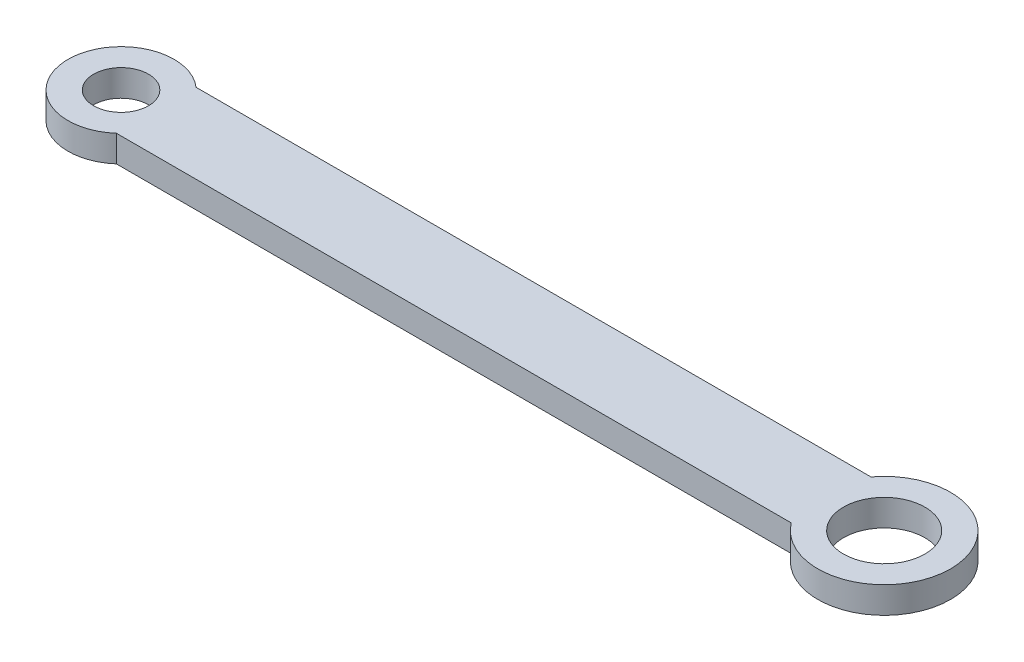
ISO-10303-21;
HEADER;
FILE_DESCRIPTION(('STEP AP214'),'2;1');
FILE_NAME('part.step','',(''),(''),'','','');
FILE_SCHEMA(('AUTOMOTIVE_DESIGN { 1 0 10303 214 1 1 1 1 }'));
ENDSEC;
DATA;
#1=APPLICATION_CONTEXT('core data for automotive mechanical design processes');
#2=APPLICATION_PROTOCOL_DEFINITION('international standard','automotive_design',2000,#1);
#3=PRODUCT_CONTEXT('',#1,'mechanical');
#4=PRODUCT('Part','Part','',(#3));
#5=PRODUCT_RELATED_PRODUCT_CATEGORY('part','',(#4));
#6=PRODUCT_DEFINITION_FORMATION('','',#4);
#7=PRODUCT_DEFINITION_CONTEXT('part definition',#1,'design');
#8=PRODUCT_DEFINITION('design','',#6,#7);
#9=PRODUCT_DEFINITION_SHAPE('','',#8);
#10=(LENGTH_UNIT() NAMED_UNIT(*) SI_UNIT(.MILLI.,.METRE.));
#11=(NAMED_UNIT(*) PLANE_ANGLE_UNIT() SI_UNIT($,.RADIAN.));
#12=(NAMED_UNIT(*) SI_UNIT($,.STERADIAN.) SOLID_ANGLE_UNIT());
#13=UNCERTAINTY_MEASURE_WITH_UNIT(LENGTH_MEASURE(1.E-05),#10,'distance_accuracy_value','');
#14=(GEOMETRIC_REPRESENTATION_CONTEXT(3) GLOBAL_UNCERTAINTY_ASSIGNED_CONTEXT((#13)) GLOBAL_UNIT_ASSIGNED_CONTEXT((#10,
#11,#12)) REPRESENTATION_CONTEXT('',''));
#15=CARTESIAN_POINT('',(0.,0.,0.));
#16=DIRECTION('',(0.,0.,1.));
#17=DIRECTION('',(1.,0.,0.));
#18=AXIS2_PLACEMENT_3D('',#15,#16,#17);
#19=CARTESIAN_POINT('',(0.,3.,0.));
#20=DIRECTION('',(0.,-1.,0.));
#21=DIRECTION('',(0.,0.,-1.));
#22=AXIS2_PLACEMENT_3D('',#19,#20,#21);
#23=CYLINDRICAL_SURFACE('',#22,6.);
#24=CARTESIAN_POINT('',(0.,0.,0.));
#25=DIRECTION('',(0.,1.,0.));
#26=DIRECTION('',(0.,0.,1.));
#27=AXIS2_PLACEMENT_3D('',#24,#25,#26);
#28=CIRCLE('',#27,6.);
#29=CARTESIAN_POINT('',(3.96862696659689,0.,-4.49999999999999));
#30=VERTEX_POINT('',#29);
#31=CARTESIAN_POINT('',(3.96862696659688,0.,4.5));
#32=VERTEX_POINT('',#31);
#33=EDGE_CURVE('E106',#30,#32,#28,.T.);
#34=ORIENTED_EDGE('',*,*,#33,.T.);
#35=DIRECTION('',(0.,-1.,0.));
#36=VECTOR('',#35,1.);
#37=CARTESIAN_POINT('',(3.96862696659688,3.,4.5));
#38=LINE('',#37,#36);
#39=CARTESIAN_POINT('',(3.96862696659688,3.,4.5));
#40=VERTEX_POINT('',#39);
#41=EDGE_CURVE('E11',#40,#32,#38,.T.);
#42=ORIENTED_EDGE('',*,*,#41,.F.);
#43=CARTESIAN_POINT('',(0.,3.,0.));
#44=DIRECTION('',(0.,1.,0.));
#45=DIRECTION('',(0.,0.,1.));
#46=AXIS2_PLACEMENT_3D('',#43,#44,#45);
#47=CIRCLE('',#46,6.);
#48=CARTESIAN_POINT('',(3.96862696659689,3.,-4.49999999999999));
#49=VERTEX_POINT('',#48);
#50=EDGE_CURVE('E76',#49,#40,#47,.T.);
#51=ORIENTED_EDGE('',*,*,#50,.F.);
#52=DIRECTION('',(0.,-1.,0.));
#53=VECTOR('',#52,1.);
#54=CARTESIAN_POINT('',(3.96862696659689,3.,-4.49999999999999));
#55=LINE('',#54,#53);
#56=EDGE_CURVE('E51',#49,#30,#55,.T.);
#57=ORIENTED_EDGE('',*,*,#56,.T.);
#58=EDGE_LOOP('',(#34,#42,#51,#57));
#59=FACE_BOUND('',#58,.T.);
#60=ADVANCED_FACE('F35',(#59),#23,.T.);
#61=CARTESIAN_POINT('',(0.,3.,4.5));
#62=DIRECTION('',(0.,0.,1.));
#63=DIRECTION('',(1.,0.,0.));
#64=AXIS2_PLACEMENT_3D('',#61,#62,#63);
#65=PLANE('',#64);
#66=DIRECTION('',(-1.,0.,0.));
#67=VECTOR('',#66,1.);
#68=CARTESIAN_POINT('',(0.,0.,4.5));
#69=LINE('',#68,#67);
#70=CARTESIAN_POINT('',(80.23,0.,4.49999999999999));
#71=VERTEX_POINT('',#70);
#72=EDGE_CURVE('E86',#71,#32,#69,.T.);
#73=ORIENTED_EDGE('',*,*,#72,.F.);
#74=DIRECTION('',(0.,-1.,0.));
#75=VECTOR('',#74,1.);
#76=CARTESIAN_POINT('',(80.23,3.,4.49999999999999));
#77=LINE('',#76,#75);
#78=CARTESIAN_POINT('',(80.23,3.,4.49999999999999));
#79=VERTEX_POINT('',#78);
#80=EDGE_CURVE('E43',#79,#71,#77,.T.);
#81=ORIENTED_EDGE('',*,*,#80,.F.);
#82=DIRECTION('',(-1.,0.,0.));
#83=VECTOR('',#82,1.);
#84=CARTESIAN_POINT('',(0.,3.,4.5));
#85=LINE('',#84,#83);
#86=EDGE_CURVE('E84',#79,#40,#85,.T.);
#87=ORIENTED_EDGE('',*,*,#86,.T.);
#88=ORIENTED_EDGE('',*,*,#41,.T.);
#89=EDGE_LOOP('',(#73,#81,#87,#88));
#90=FACE_BOUND('',#89,.T.);
#91=ADVANCED_FACE('F83',(#90),#65,.T.);
#92=CARTESIAN_POINT('',(86.23,3.,0.));
#93=DIRECTION('',(0.,-1.,0.));
#94=DIRECTION('',(0.,0.,-1.));
#95=AXIS2_PLACEMENT_3D('',#92,#93,#94);
#96=CYLINDRICAL_SURFACE('',#95,7.50000000000001);
#97=CARTESIAN_POINT('',(86.23,0.,0.));
#98=DIRECTION('',(0.,1.,0.));
#99=DIRECTION('',(0.,0.,1.));
#100=AXIS2_PLACEMENT_3D('',#97,#98,#99);
#101=CIRCLE('',#100,7.50000000000001);
#102=CARTESIAN_POINT('',(80.23,0.,-4.49999999999999));
#103=VERTEX_POINT('',#102);
#104=EDGE_CURVE('E109',#71,#103,#101,.T.);
#105=ORIENTED_EDGE('',*,*,#104,.T.);
#106=DIRECTION('',(0.,-1.,0.));
#107=VECTOR('',#106,1.);
#108=CARTESIAN_POINT('',(80.23,3.,-4.49999999999999));
#109=LINE('',#108,#107);
#110=CARTESIAN_POINT('',(80.23,3.,-4.49999999999999));
#111=VERTEX_POINT('',#110);
#112=EDGE_CURVE('E65',#111,#103,#109,.T.);
#113=ORIENTED_EDGE('',*,*,#112,.F.);
#114=CARTESIAN_POINT('',(86.23,3.,0.));
#115=DIRECTION('',(0.,1.,0.));
#116=DIRECTION('',(0.,0.,1.));
#117=AXIS2_PLACEMENT_3D('',#114,#115,#116);
#118=CIRCLE('',#117,7.50000000000001);
#119=EDGE_CURVE('E89',#79,#111,#118,.T.);
#120=ORIENTED_EDGE('',*,*,#119,.F.);
#121=ORIENTED_EDGE('',*,*,#80,.T.);
#122=EDGE_LOOP('',(#105,#113,#120,#121));
#123=FACE_BOUND('',#122,.T.);
#124=ADVANCED_FACE('F90',(#123),#96,.T.);
#125=CARTESIAN_POINT('',(0.,3.,0.));
#126=DIRECTION('',(0.,-1.,0.));
#127=DIRECTION('',(0.,0.,-1.));
#128=AXIS2_PLACEMENT_3D('',#125,#126,#127);
#129=CYLINDRICAL_SURFACE('',#128,3.1);
#130=CARTESIAN_POINT('',(0.,3.,0.));
#131=DIRECTION('',(0.,1.,0.));
#132=DIRECTION('',(0.,0.,1.));
#133=AXIS2_PLACEMENT_3D('',#130,#131,#132);
#134=CIRCLE('',#133,3.1);
#135=CARTESIAN_POINT('',(0.,3.,3.1));
#136=VERTEX_POINT('',#135);
#137=EDGE_CURVE('E100',#136,#136,#134,.T.);
#138=ORIENTED_EDGE('',*,*,#137,.T.);
#139=EDGE_LOOP('',(#138));
#140=FACE_BOUND('',#139,.T.);
#141=CARTESIAN_POINT('',(0.,0.,0.));
#142=DIRECTION('',(0.,1.,0.));
#143=DIRECTION('',(0.,0.,1.));
#144=AXIS2_PLACEMENT_3D('',#141,#142,#143);
#145=CIRCLE('',#144,3.1);
#146=CARTESIAN_POINT('',(0.,0.,3.1));
#147=VERTEX_POINT('',#146);
#148=EDGE_CURVE('E114',#147,#147,#145,.T.);
#149=ORIENTED_EDGE('',*,*,#148,.F.);
#150=EDGE_LOOP('',(#149));
#151=FACE_BOUND('',#150,.T.);
#152=ADVANCED_FACE('F134',(#140,#151),#129,.F.);
#153=CARTESIAN_POINT('',(0.,3.,-4.49999999999999));
#154=DIRECTION('',(0.,0.,-1.));
#155=DIRECTION('',(-1.,0.,0.));
#156=AXIS2_PLACEMENT_3D('',#153,#154,#155);
#157=PLANE('',#156);
#158=DIRECTION('',(1.,0.,0.));
#159=VECTOR('',#158,1.);
#160=CARTESIAN_POINT('',(0.,0.,-4.49999999999999));
#161=LINE('',#160,#159);
#162=EDGE_CURVE('E111',#30,#103,#161,.T.);
#163=ORIENTED_EDGE('',*,*,#162,.F.);
#164=ORIENTED_EDGE('',*,*,#56,.F.);
#165=DIRECTION('',(1.,0.,0.));
#166=VECTOR('',#165,1.);
#167=CARTESIAN_POINT('',(0.,3.,-4.49999999999999));
#168=LINE('',#167,#166);
#169=EDGE_CURVE('E91',#49,#111,#168,.T.);
#170=ORIENTED_EDGE('',*,*,#169,.T.);
#171=ORIENTED_EDGE('',*,*,#112,.T.);
#172=EDGE_LOOP('',(#163,#164,#170,#171));
#173=FACE_BOUND('',#172,.T.);
#174=ADVANCED_FACE('F126',(#173),#157,.T.);
#175=CARTESIAN_POINT('',(86.23,3.,0.));
#176=DIRECTION('',(0.,-1.,0.));
#177=DIRECTION('',(0.,0.,-1.));
#178=AXIS2_PLACEMENT_3D('',#175,#176,#177);
#179=CYLINDRICAL_SURFACE('',#178,4.6);
#180=CARTESIAN_POINT('',(86.23,3.,0.));
#181=DIRECTION('',(0.,1.,0.));
#182=DIRECTION('',(0.,0.,1.));
#183=AXIS2_PLACEMENT_3D('',#180,#181,#182);
#184=CIRCLE('',#183,4.6);
#185=CARTESIAN_POINT('',(86.23,3.,4.6));
#186=VERTEX_POINT('',#185);
#187=EDGE_CURVE('E103',#186,#186,#184,.T.);
#188=ORIENTED_EDGE('',*,*,#187,.T.);
#189=EDGE_LOOP('',(#188));
#190=FACE_BOUND('',#189,.T.);
#191=CARTESIAN_POINT('',(86.23,0.,0.));
#192=DIRECTION('',(0.,1.,0.));
#193=DIRECTION('',(0.,0.,1.));
#194=AXIS2_PLACEMENT_3D('',#191,#192,#193);
#195=CIRCLE('',#194,4.6);
#196=CARTESIAN_POINT('',(86.23,0.,4.6));
#197=VERTEX_POINT('',#196);
#198=EDGE_CURVE('E96',#197,#197,#195,.T.);
#199=ORIENTED_EDGE('',*,*,#198,.F.);
#200=EDGE_LOOP('',(#199));
#201=FACE_BOUND('',#200,.T.);
#202=ADVANCED_FACE('F124',(#190,#201),#179,.F.);
#203=CARTESIAN_POINT('',(0.,3.,0.));
#204=DIRECTION('',(0.,1.,0.));
#205=DIRECTION('',(0.,0.,1.));
#206=AXIS2_PLACEMENT_3D('',#203,#204,#205);
#207=PLANE('',#206);
#208=ORIENTED_EDGE('',*,*,#50,.T.);
#209=ORIENTED_EDGE('',*,*,#86,.F.);
#210=ORIENTED_EDGE('',*,*,#119,.T.);
#211=ORIENTED_EDGE('',*,*,#169,.F.);
#212=EDGE_LOOP('',(#208,#209,#210,#211));
#213=FACE_BOUND('',#212,.T.);
#214=ORIENTED_EDGE('',*,*,#137,.F.);
#215=EDGE_LOOP('',(#214));
#216=FACE_BOUND('',#215,.T.);
#217=ORIENTED_EDGE('',*,*,#187,.F.);
#218=EDGE_LOOP('',(#217));
#219=FACE_BOUND('',#218,.T.);
#220=ADVANCED_FACE('F93',(#213,#216,#219),#207,.T.);
#221=CARTESIAN_POINT('',(0.,0.,0.));
#222=DIRECTION('',(0.,1.,0.));
#223=DIRECTION('',(0.,0.,1.));
#224=AXIS2_PLACEMENT_3D('',#221,#222,#223);
#225=PLANE('',#224);
#226=ORIENTED_EDGE('',*,*,#33,.F.);
#227=ORIENTED_EDGE('',*,*,#162,.T.);
#228=ORIENTED_EDGE('',*,*,#104,.F.);
#229=ORIENTED_EDGE('',*,*,#72,.T.);
#230=EDGE_LOOP('',(#226,#227,#228,#229));
#231=FACE_BOUND('',#230,.T.);
#232=ORIENTED_EDGE('',*,*,#148,.T.);
#233=EDGE_LOOP('',(#232));
#234=FACE_BOUND('',#233,.T.);
#235=ORIENTED_EDGE('',*,*,#198,.T.);
#236=EDGE_LOOP('',(#235));
#237=FACE_BOUND('',#236,.T.);
#238=ADVANCED_FACE('F122',(#231,#234,#237),#225,.F.);
#239=CLOSED_SHELL('',(#60,#91,#124,#152,#174,#202,#220,#238));
#240=MANIFOLD_SOLID_BREP('B2',#239);
#241=ADVANCED_BREP_SHAPE_REPRESENTATION('',(#18,#240),#14);
#242=SHAPE_DEFINITION_REPRESENTATION(#9,#241);
ENDSEC;
END-ISO-10303-21;
